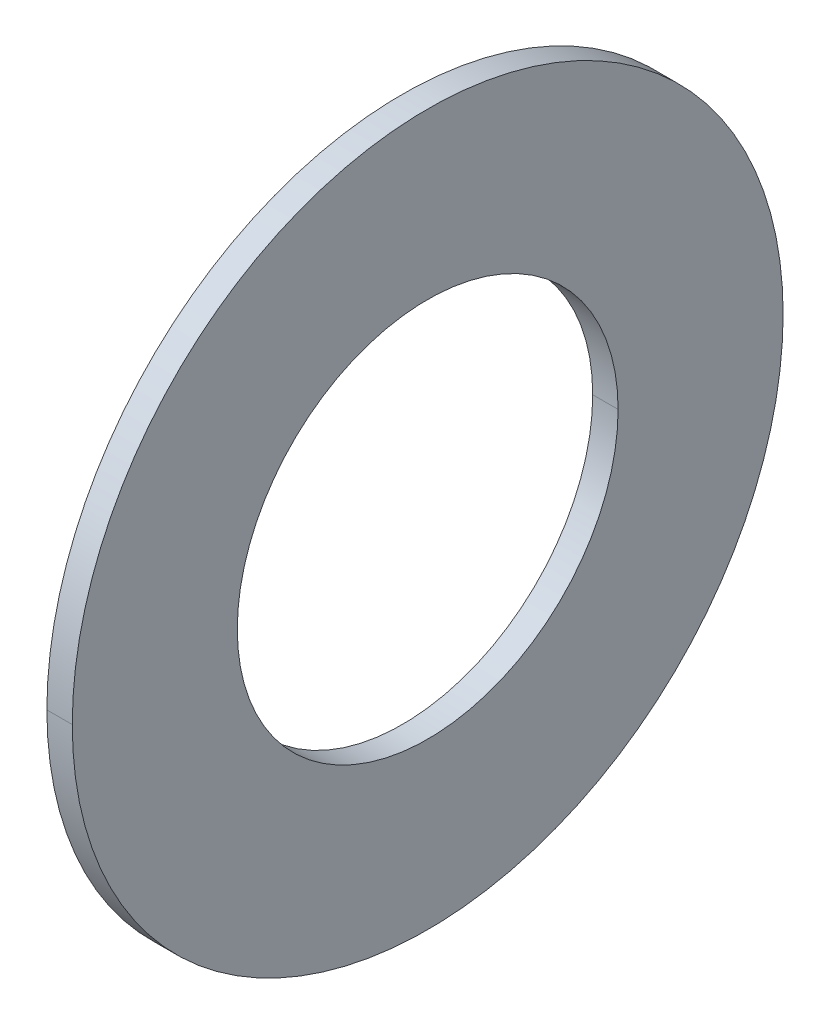
ISO-10303-21;
HEADER;
FILE_DESCRIPTION(('STEP AP214'),'2;1');
FILE_NAME('part.step','',(''),(''),'','','');
FILE_SCHEMA(('AUTOMOTIVE_DESIGN { 1 0 10303 214 1 1 1 1 }'));
ENDSEC;
DATA;
#1=APPLICATION_CONTEXT('core data for automotive mechanical design processes');
#2=APPLICATION_PROTOCOL_DEFINITION('international standard','automotive_design',2000,#1);
#3=PRODUCT_CONTEXT('',#1,'mechanical');
#4=PRODUCT('Part','Part','',(#3));
#5=PRODUCT_RELATED_PRODUCT_CATEGORY('part','',(#4));
#6=PRODUCT_DEFINITION_FORMATION('','',#4);
#7=PRODUCT_DEFINITION_CONTEXT('part definition',#1,'design');
#8=PRODUCT_DEFINITION('design','',#6,#7);
#9=PRODUCT_DEFINITION_SHAPE('','',#8);
#10=(LENGTH_UNIT() NAMED_UNIT(*) SI_UNIT(.MILLI.,.METRE.));
#11=(NAMED_UNIT(*) PLANE_ANGLE_UNIT() SI_UNIT($,.RADIAN.));
#12=(NAMED_UNIT(*) SI_UNIT($,.STERADIAN.) SOLID_ANGLE_UNIT());
#13=UNCERTAINTY_MEASURE_WITH_UNIT(LENGTH_MEASURE(1.E-05),#10,'distance_accuracy_value','');
#14=(GEOMETRIC_REPRESENTATION_CONTEXT(3) GLOBAL_UNCERTAINTY_ASSIGNED_CONTEXT((#13)) GLOBAL_UNIT_ASSIGNED_CONTEXT((#10,
#11,#12)) REPRESENTATION_CONTEXT('',''));
#15=CARTESIAN_POINT('',(0.,0.,0.));
#16=DIRECTION('',(0.,0.,1.));
#17=DIRECTION('',(1.,0.,0.));
#18=AXIS2_PLACEMENT_3D('',#15,#16,#17);
#19=CARTESIAN_POINT('',(1.,14.,0.));
#20=DIRECTION('',(-1.,0.,0.));
#21=DIRECTION('',(0.,0.,1.));
#22=AXIS2_PLACEMENT_3D('',#19,#20,#21);
#23=PLANE('',#22);
#24=CARTESIAN_POINT('',(1.,0.,0.));
#25=DIRECTION('',(1.,0.,0.));
#26=DIRECTION('',(0.,0.,-1.));
#27=AXIS2_PLACEMENT_3D('',#24,#25,#26);
#28=CIRCLE('',#27,7.5);
#29=CARTESIAN_POINT('',(1.,0.,-7.5));
#30=VERTEX_POINT('',#29);
#31=CARTESIAN_POINT('',(1.,0.,7.5));
#32=VERTEX_POINT('',#31);
#33=EDGE_CURVE('E11',#30,#32,#28,.T.);
#34=ORIENTED_EDGE('',*,*,#33,.T.);
#35=CARTESIAN_POINT('',(1.,0.,0.));
#36=DIRECTION('',(1.,0.,0.));
#37=DIRECTION('',(0.,0.,-1.));
#38=AXIS2_PLACEMENT_3D('',#35,#36,#37);
#39=CIRCLE('',#38,7.5);
#40=EDGE_CURVE('E25',#32,#30,#39,.T.);
#41=ORIENTED_EDGE('',*,*,#40,.T.);
#42=EDGE_LOOP('',(#34,#41));
#43=FACE_BOUND('',#42,.T.);
#44=CARTESIAN_POINT('',(1.,0.,0.));
#45=DIRECTION('',(1.,0.,0.));
#46=DIRECTION('',(0.,0.,-1.));
#47=AXIS2_PLACEMENT_3D('',#44,#45,#46);
#48=CIRCLE('',#47,14.);
#49=CARTESIAN_POINT('',(1.,0.,14.));
#50=VERTEX_POINT('',#49);
#51=CARTESIAN_POINT('',(1.,0.,-14.));
#52=VERTEX_POINT('',#51);
#53=EDGE_CURVE('E95',#50,#52,#48,.T.);
#54=ORIENTED_EDGE('',*,*,#53,.F.);
#55=CARTESIAN_POINT('',(1.,0.,0.));
#56=DIRECTION('',(1.,0.,0.));
#57=DIRECTION('',(0.,0.,-1.));
#58=AXIS2_PLACEMENT_3D('',#55,#56,#57);
#59=CIRCLE('',#58,14.);
#60=EDGE_CURVE('E90',#52,#50,#59,.T.);
#61=ORIENTED_EDGE('',*,*,#60,.F.);
#62=EDGE_LOOP('',(#54,#61));
#63=FACE_BOUND('',#62,.T.);
#64=ADVANCED_FACE('F17',(#43,#63),#23,.T.);
#65=CARTESIAN_POINT('',(50.,0.,0.));
#66=DIRECTION('',(1.,0.,0.));
#67=DIRECTION('',(0.,-1.,0.));
#68=AXIS2_PLACEMENT_3D('',#65,#66,#67);
#69=CYLINDRICAL_SURFACE('',#68,14.);
#70=DIRECTION('',(1.,0.,0.));
#71=VECTOR('',#70,1.);
#72=CARTESIAN_POINT('',(1.,0.,14.));
#73=LINE('',#72,#71);
#74=CARTESIAN_POINT('',(2.,0.,14.));
#75=VERTEX_POINT('',#74);
#76=EDGE_CURVE('E86',#50,#75,#73,.T.);
#77=ORIENTED_EDGE('',*,*,#76,.T.);
#78=CARTESIAN_POINT('',(2.,0.,0.));
#79=DIRECTION('',(1.,0.,0.));
#80=DIRECTION('',(0.,0.,-1.));
#81=AXIS2_PLACEMENT_3D('',#78,#79,#80);
#82=CIRCLE('',#81,14.);
#83=CARTESIAN_POINT('',(2.,0.,-14.));
#84=VERTEX_POINT('',#83);
#85=EDGE_CURVE('E81',#84,#75,#82,.T.);
#86=ORIENTED_EDGE('',*,*,#85,.F.);
#87=DIRECTION('',(1.,0.,0.));
#88=VECTOR('',#87,1.);
#89=CARTESIAN_POINT('',(1.,0.,-14.));
#90=LINE('',#89,#88);
#91=EDGE_CURVE('E70',#52,#84,#90,.T.);
#92=ORIENTED_EDGE('',*,*,#91,.F.);
#93=ORIENTED_EDGE('',*,*,#60,.T.);
#94=EDGE_LOOP('',(#77,#86,#92,#93));
#95=FACE_BOUND('',#94,.T.);
#96=ADVANCED_FACE('F111',(#95),#69,.T.);
#97=CARTESIAN_POINT('',(50.,0.,0.));
#98=DIRECTION('',(1.,0.,0.));
#99=DIRECTION('',(0.,1.,0.));
#100=AXIS2_PLACEMENT_3D('',#97,#98,#99);
#101=CYLINDRICAL_SURFACE('',#100,14.);
#102=ORIENTED_EDGE('',*,*,#76,.F.);
#103=ORIENTED_EDGE('',*,*,#53,.T.);
#104=ORIENTED_EDGE('',*,*,#91,.T.);
#105=CARTESIAN_POINT('',(2.,0.,0.));
#106=DIRECTION('',(1.,0.,0.));
#107=DIRECTION('',(0.,0.,-1.));
#108=AXIS2_PLACEMENT_3D('',#105,#106,#107);
#109=CIRCLE('',#108,14.);
#110=EDGE_CURVE('E67',#75,#84,#109,.T.);
#111=ORIENTED_EDGE('',*,*,#110,.F.);
#112=EDGE_LOOP('',(#102,#103,#104,#111));
#113=FACE_BOUND('',#112,.T.);
#114=ADVANCED_FACE('F106',(#113),#101,.T.);
#115=CARTESIAN_POINT('',(2.,7.5,0.));
#116=DIRECTION('',(1.,0.,0.));
#117=DIRECTION('',(0.,0.,-1.));
#118=AXIS2_PLACEMENT_3D('',#115,#116,#117);
#119=PLANE('',#118);
#120=ORIENTED_EDGE('',*,*,#85,.T.);
#121=ORIENTED_EDGE('',*,*,#110,.T.);
#122=EDGE_LOOP('',(#120,#121));
#123=FACE_BOUND('',#122,.T.);
#124=CARTESIAN_POINT('',(2.,0.,0.));
#125=DIRECTION('',(1.,0.,0.));
#126=DIRECTION('',(0.,0.,-1.));
#127=AXIS2_PLACEMENT_3D('',#124,#125,#126);
#128=CIRCLE('',#127,7.5);
#129=CARTESIAN_POINT('',(2.,0.,7.5));
#130=VERTEX_POINT('',#129);
#131=CARTESIAN_POINT('',(2.,0.,-7.5));
#132=VERTEX_POINT('',#131);
#133=EDGE_CURVE('E55',#130,#132,#128,.T.);
#134=ORIENTED_EDGE('',*,*,#133,.F.);
#135=CARTESIAN_POINT('',(2.,0.,0.));
#136=DIRECTION('',(1.,0.,0.));
#137=DIRECTION('',(0.,0.,-1.));
#138=AXIS2_PLACEMENT_3D('',#135,#136,#137);
#139=CIRCLE('',#138,7.5);
#140=EDGE_CURVE('E51',#132,#130,#139,.T.);
#141=ORIENTED_EDGE('',*,*,#140,.F.);
#142=EDGE_LOOP('',(#134,#141));
#143=FACE_BOUND('',#142,.T.);
#144=ADVANCED_FACE('F53',(#123,#143),#119,.T.);
#145=CARTESIAN_POINT('',(50.,0.,0.));
#146=DIRECTION('',(1.,0.,0.));
#147=DIRECTION('',(0.,-1.,0.));
#148=AXIS2_PLACEMENT_3D('',#145,#146,#147);
#149=CYLINDRICAL_SURFACE('',#148,7.5);
#150=DIRECTION('',(1.,0.,0.));
#151=VECTOR('',#150,1.);
#152=CARTESIAN_POINT('',(1.,0.,7.5));
#153=LINE('',#152,#151);
#154=EDGE_CURVE('E59',#32,#130,#153,.T.);
#155=ORIENTED_EDGE('',*,*,#154,.F.);
#156=ORIENTED_EDGE('',*,*,#33,.F.);
#157=DIRECTION('',(1.,0.,0.));
#158=VECTOR('',#157,1.);
#159=CARTESIAN_POINT('',(1.,0.,-7.5));
#160=LINE('',#159,#158);
#161=EDGE_CURVE('E62',#30,#132,#160,.T.);
#162=ORIENTED_EDGE('',*,*,#161,.T.);
#163=ORIENTED_EDGE('',*,*,#140,.T.);
#164=EDGE_LOOP('',(#155,#156,#162,#163));
#165=FACE_BOUND('',#164,.T.);
#166=ADVANCED_FACE('F63',(#165),#149,.F.);
#167=CARTESIAN_POINT('',(50.,0.,0.));
#168=DIRECTION('',(1.,0.,0.));
#169=DIRECTION('',(0.,1.,0.));
#170=AXIS2_PLACEMENT_3D('',#167,#168,#169);
#171=CYLINDRICAL_SURFACE('',#170,7.5);
#172=ORIENTED_EDGE('',*,*,#154,.T.);
#173=ORIENTED_EDGE('',*,*,#133,.T.);
#174=ORIENTED_EDGE('',*,*,#161,.F.);
#175=ORIENTED_EDGE('',*,*,#40,.F.);
#176=EDGE_LOOP('',(#172,#173,#174,#175));
#177=FACE_BOUND('',#176,.T.);
#178=ADVANCED_FACE('F66',(#177),#171,.F.);
#179=CLOSED_SHELL('',(#64,#96,#114,#144,#166,#178));
#180=MANIFOLD_SOLID_BREP('B1',#179);
#181=ADVANCED_BREP_SHAPE_REPRESENTATION('',(#18,#180),#14);
#182=SHAPE_DEFINITION_REPRESENTATION(#9,#181);
ENDSEC;
END-ISO-10303-21;
